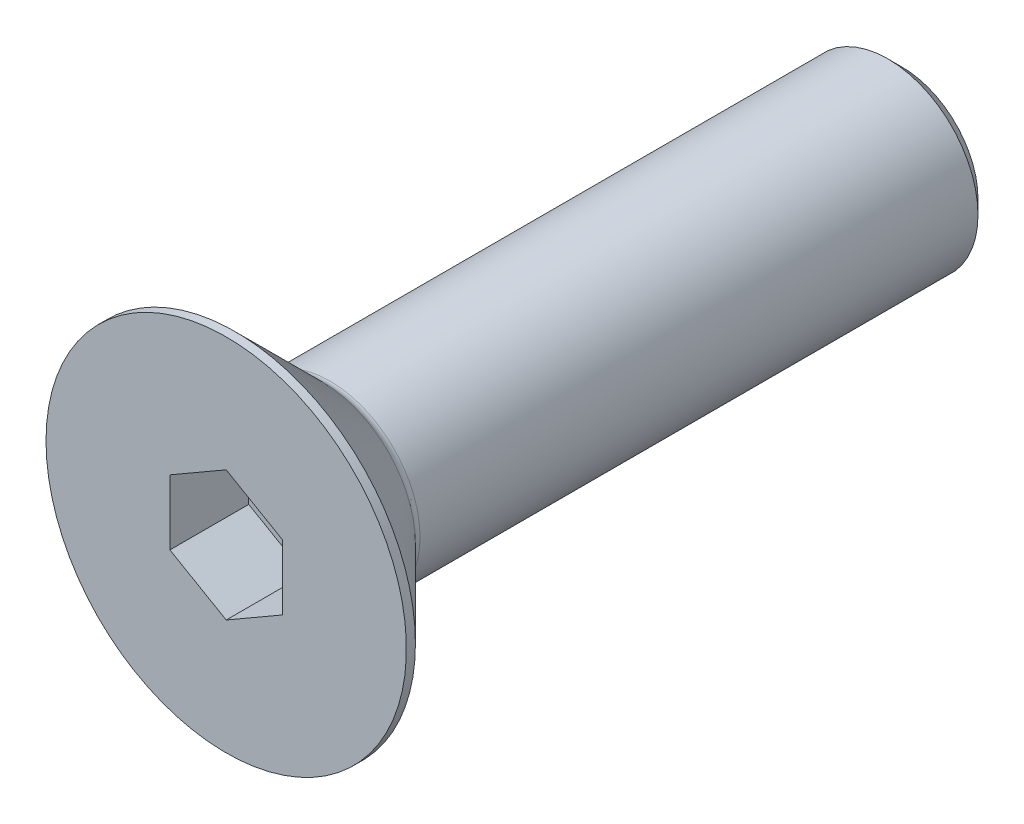
ISO-10303-21;
HEADER;
FILE_DESCRIPTION(('STEP AP214'),'2;1');
FILE_NAME('part.step','',(''),(''),'','','');
FILE_SCHEMA(('AUTOMOTIVE_DESIGN { 1 0 10303 214 1 1 1 1 }'));
ENDSEC;
DATA;
#1=APPLICATION_CONTEXT('core data for automotive mechanical design processes');
#2=APPLICATION_PROTOCOL_DEFINITION('international standard','automotive_design',2000,#1);
#3=PRODUCT_CONTEXT('',#1,'mechanical');
#4=PRODUCT('Part','Part','',(#3));
#5=PRODUCT_RELATED_PRODUCT_CATEGORY('part','',(#4));
#6=PRODUCT_DEFINITION_FORMATION('','',#4);
#7=PRODUCT_DEFINITION_CONTEXT('part definition',#1,'design');
#8=PRODUCT_DEFINITION('design','',#6,#7);
#9=PRODUCT_DEFINITION_SHAPE('','',#8);
#10=(LENGTH_UNIT() NAMED_UNIT(*) SI_UNIT(.MILLI.,.METRE.));
#11=(NAMED_UNIT(*) PLANE_ANGLE_UNIT() SI_UNIT($,.RADIAN.));
#12=(NAMED_UNIT(*) SI_UNIT($,.STERADIAN.) SOLID_ANGLE_UNIT());
#13=UNCERTAINTY_MEASURE_WITH_UNIT(LENGTH_MEASURE(1.E-05),#10,'distance_accuracy_value','');
#14=(GEOMETRIC_REPRESENTATION_CONTEXT(3) GLOBAL_UNCERTAINTY_ASSIGNED_CONTEXT((#13)) GLOBAL_UNIT_ASSIGNED_CONTEXT((#10,
#11,#12)) REPRESENTATION_CONTEXT('',''));
#15=CARTESIAN_POINT('',(0.,0.,0.));
#16=DIRECTION('',(0.,0.,1.));
#17=DIRECTION('',(1.,0.,0.));
#18=AXIS2_PLACEMENT_3D('',#15,#16,#17);
#19=CARTESIAN_POINT('',(0.,0.,-3.5));
#20=DIRECTION('',(0.,0.,1.));
#21=DIRECTION('',(1.,0.,0.));
#22=AXIS2_PLACEMENT_3D('',#19,#20,#21);
#23=PLANE('',#22);
#24=DIRECTION('',(-0.866025403784439,-0.5,0.));
#25=VECTOR('',#24,1.);
#26=CARTESIAN_POINT('',(0.,2.88675134594813,-3.5));
#27=LINE('',#26,#25);
#28=CARTESIAN_POINT('',(0.,2.88675134594813,-3.5));
#29=VERTEX_POINT('',#28);
#30=CARTESIAN_POINT('',(-2.5,1.44337567297406,-3.5));
#31=VERTEX_POINT('',#30);
#32=EDGE_CURVE('E82',#29,#31,#27,.T.);
#33=ORIENTED_EDGE('',*,*,#32,.T.);
#34=DIRECTION('',(0.,1.,0.));
#35=VECTOR('',#34,1.);
#36=CARTESIAN_POINT('',(-2.5,1.44337567297406,-3.5));
#37=LINE('',#36,#35);
#38=CARTESIAN_POINT('',(-2.5,-1.44337567297407,-3.5));
#39=VERTEX_POINT('',#38);
#40=EDGE_CURVE('E66',#31,#39,#37,.F.);
#41=ORIENTED_EDGE('',*,*,#40,.T.);
#42=DIRECTION('',(0.866025403784439,-0.499999999999999,0.));
#43=VECTOR('',#42,1.);
#44=CARTESIAN_POINT('',(-2.5,-1.44337567297407,-3.5));
#45=LINE('',#44,#43);
#46=CARTESIAN_POINT('',(0.,-2.88675134594813,-3.5));
#47=VERTEX_POINT('',#46);
#48=EDGE_CURVE('E71',#39,#47,#45,.T.);
#49=ORIENTED_EDGE('',*,*,#48,.T.);
#50=DIRECTION('',(0.866025403784439,0.5,0.));
#51=VECTOR('',#50,1.);
#52=CARTESIAN_POINT('',(0.,-2.88675134594813,-3.5));
#53=LINE('',#52,#51);
#54=CARTESIAN_POINT('',(2.5,-1.44337567297406,-3.5));
#55=VERTEX_POINT('',#54);
#56=EDGE_CURVE('E128',#47,#55,#53,.T.);
#57=ORIENTED_EDGE('',*,*,#56,.T.);
#58=DIRECTION('',(0.,1.,0.));
#59=VECTOR('',#58,1.);
#60=CARTESIAN_POINT('',(2.5,-1.44337567297406,-3.5));
#61=LINE('',#60,#59);
#62=CARTESIAN_POINT('',(2.5,1.44337567297407,-3.5));
#63=VERTEX_POINT('',#62);
#64=EDGE_CURVE('E132',#55,#63,#61,.T.);
#65=ORIENTED_EDGE('',*,*,#64,.T.);
#66=DIRECTION('',(-0.866025403784439,0.499999999999999,0.));
#67=VECTOR('',#66,1.);
#68=CARTESIAN_POINT('',(2.5,1.44337567297407,-3.5));
#69=LINE('',#68,#67);
#70=EDGE_CURVE('E137',#63,#29,#69,.T.);
#71=ORIENTED_EDGE('',*,*,#70,.T.);
#72=EDGE_LOOP('',(#33,#41,#49,#57,#65,#71));
#73=FACE_BOUND('',#72,.T.);
#74=ADVANCED_FACE('F15',(#73),#23,.T.);
#75=CARTESIAN_POINT('',(-2.5,-1.44337567297407,0.));
#76=DIRECTION('',(-0.499999999999999,-0.866025403784439,0.));
#77=DIRECTION('',(0.866025403784439,-0.499999999999999,0.));
#78=AXIS2_PLACEMENT_3D('',#75,#76,#77);
#79=PLANE('',#78);
#80=DIRECTION('',(0.,0.,1.));
#81=VECTOR('',#80,1.);
#82=CARTESIAN_POINT('',(-2.5,-1.44337567297407,0.));
#83=LINE('',#82,#81);
#84=CARTESIAN_POINT('',(-2.5,-1.44337567297407,0.));
#85=VERTEX_POINT('',#84);
#86=EDGE_CURVE('E73',#39,#85,#83,.T.);
#87=ORIENTED_EDGE('',*,*,#86,.T.);
#88=DIRECTION('',(-0.866025403784439,0.499999999999999,0.));
#89=VECTOR('',#88,1.);
#90=CARTESIAN_POINT('',(0.,-2.88675134594813,0.));
#91=LINE('',#90,#89);
#92=CARTESIAN_POINT('',(0.,-2.88675134594813,0.));
#93=VERTEX_POINT('',#92);
#94=EDGE_CURVE('E126',#93,#85,#91,.T.);
#95=ORIENTED_EDGE('',*,*,#94,.F.);
#96=DIRECTION('',(0.,0.,1.));
#97=VECTOR('',#96,1.);
#98=CARTESIAN_POINT('',(0.,-2.88675134594813,0.));
#99=LINE('',#98,#97);
#100=EDGE_CURVE('E76',#93,#47,#99,.F.);
#101=ORIENTED_EDGE('',*,*,#100,.T.);
#102=ORIENTED_EDGE('',*,*,#48,.F.);
#103=EDGE_LOOP('',(#87,#95,#101,#102));
#104=FACE_BOUND('',#103,.T.);
#105=ADVANCED_FACE('F72',(#104),#79,.F.);
#106=CARTESIAN_POINT('',(-2.5,1.44337567297406,0.));
#107=DIRECTION('',(-1.,0.,0.));
#108=DIRECTION('',(0.,0.,1.));
#109=AXIS2_PLACEMENT_3D('',#106,#107,#108);
#110=PLANE('',#109);
#111=DIRECTION('',(0.,0.,1.));
#112=VECTOR('',#111,1.);
#113=CARTESIAN_POINT('',(-2.5,1.44337567297406,0.));
#114=LINE('',#113,#112);
#115=CARTESIAN_POINT('',(-2.5,1.44337567297406,0.));
#116=VERTEX_POINT('',#115);
#117=EDGE_CURVE('E84',#31,#116,#114,.T.);
#118=ORIENTED_EDGE('',*,*,#117,.T.);
#119=DIRECTION('',(0.,1.,0.));
#120=VECTOR('',#119,1.);
#121=CARTESIAN_POINT('',(-2.5,0.,0.));
#122=LINE('',#121,#120);
#123=EDGE_CURVE('E88',#85,#116,#122,.T.);
#124=ORIENTED_EDGE('',*,*,#123,.F.);
#125=ORIENTED_EDGE('',*,*,#86,.F.);
#126=ORIENTED_EDGE('',*,*,#40,.F.);
#127=EDGE_LOOP('',(#118,#124,#125,#126));
#128=FACE_BOUND('',#127,.T.);
#129=ADVANCED_FACE('F86',(#128),#110,.F.);
#130=CARTESIAN_POINT('',(0.,2.88675134594813,0.));
#131=DIRECTION('',(-0.5,0.866025403784439,0.));
#132=DIRECTION('',(-0.866025403784439,-0.5,0.));
#133=AXIS2_PLACEMENT_3D('',#130,#131,#132);
#134=PLANE('',#133);
#135=DIRECTION('',(0.,0.,1.));
#136=VECTOR('',#135,1.);
#137=CARTESIAN_POINT('',(0.,2.88675134594813,0.));
#138=LINE('',#137,#136);
#139=CARTESIAN_POINT('',(0.,2.88675134594813,0.));
#140=VERTEX_POINT('',#139);
#141=EDGE_CURVE('E139',#29,#140,#138,.T.);
#142=ORIENTED_EDGE('',*,*,#141,.T.);
#143=DIRECTION('',(0.866025403784439,0.499999999999999,0.));
#144=VECTOR('',#143,1.);
#145=CARTESIAN_POINT('',(-2.5,1.44337567297406,0.));
#146=LINE('',#145,#144);
#147=EDGE_CURVE('E122',#116,#140,#146,.T.);
#148=ORIENTED_EDGE('',*,*,#147,.F.);
#149=ORIENTED_EDGE('',*,*,#117,.F.);
#150=ORIENTED_EDGE('',*,*,#32,.F.);
#151=EDGE_LOOP('',(#142,#148,#149,#150));
#152=FACE_BOUND('',#151,.T.);
#153=ADVANCED_FACE('F143',(#152),#134,.F.);
#154=CARTESIAN_POINT('',(2.5,1.44337567297407,0.));
#155=DIRECTION('',(0.499999999999999,0.866025403784439,0.));
#156=DIRECTION('',(-0.866025403784439,0.499999999999999,0.));
#157=AXIS2_PLACEMENT_3D('',#154,#155,#156);
#158=PLANE('',#157);
#159=DIRECTION('',(0.,0.,-1.));
#160=VECTOR('',#159,1.);
#161=CARTESIAN_POINT('',(2.5,1.44337567297407,0.));
#162=LINE('',#161,#160);
#163=CARTESIAN_POINT('',(2.5,1.44337567297407,0.));
#164=VERTEX_POINT('',#163);
#165=EDGE_CURVE('E135',#63,#164,#162,.F.);
#166=ORIENTED_EDGE('',*,*,#165,.T.);
#167=DIRECTION('',(0.866025403784439,-0.499999999999999,0.));
#168=VECTOR('',#167,1.);
#169=CARTESIAN_POINT('',(0.,2.88675134594813,0.));
#170=LINE('',#169,#168);
#171=EDGE_CURVE('E119',#140,#164,#170,.T.);
#172=ORIENTED_EDGE('',*,*,#171,.F.);
#173=ORIENTED_EDGE('',*,*,#141,.F.);
#174=ORIENTED_EDGE('',*,*,#70,.F.);
#175=EDGE_LOOP('',(#166,#172,#173,#174));
#176=FACE_BOUND('',#175,.T.);
#177=ADVANCED_FACE('F154',(#176),#158,.F.);
#178=CARTESIAN_POINT('',(2.5,-1.44337567297406,0.));
#179=DIRECTION('',(1.,0.,0.));
#180=DIRECTION('',(0.,0.,-1.));
#181=AXIS2_PLACEMENT_3D('',#178,#179,#180);
#182=PLANE('',#181);
#183=DIRECTION('',(0.,0.,1.));
#184=VECTOR('',#183,1.);
#185=CARTESIAN_POINT('',(2.5,-1.44337567297406,0.));
#186=LINE('',#185,#184);
#187=CARTESIAN_POINT('',(2.5,-1.44337567297406,0.));
#188=VERTEX_POINT('',#187);
#189=EDGE_CURVE('E34',#55,#188,#186,.T.);
#190=ORIENTED_EDGE('',*,*,#189,.T.);
#191=DIRECTION('',(0.,1.,0.));
#192=VECTOR('',#191,1.);
#193=CARTESIAN_POINT('',(2.5,0.,0.));
#194=LINE('',#193,#192);
#195=EDGE_CURVE('E116',#164,#188,#194,.F.);
#196=ORIENTED_EDGE('',*,*,#195,.F.);
#197=ORIENTED_EDGE('',*,*,#165,.F.);
#198=ORIENTED_EDGE('',*,*,#64,.F.);
#199=EDGE_LOOP('',(#190,#196,#197,#198));
#200=FACE_BOUND('',#199,.T.);
#201=ADVANCED_FACE('F152',(#200),#182,.F.);
#202=CARTESIAN_POINT('',(0.,-2.88675134594813,0.));
#203=DIRECTION('',(0.5,-0.866025403784439,0.));
#204=DIRECTION('',(0.866025403784439,0.5,0.));
#205=AXIS2_PLACEMENT_3D('',#202,#203,#204);
#206=PLANE('',#205);
#207=ORIENTED_EDGE('',*,*,#100,.F.);
#208=DIRECTION('',(-0.866025403784439,-0.499999999999999,0.));
#209=VECTOR('',#208,1.);
#210=CARTESIAN_POINT('',(2.5,-1.44337567297406,0.));
#211=LINE('',#210,#209);
#212=EDGE_CURVE('E113',#188,#93,#211,.T.);
#213=ORIENTED_EDGE('',*,*,#212,.F.);
#214=ORIENTED_EDGE('',*,*,#189,.F.);
#215=ORIENTED_EDGE('',*,*,#56,.F.);
#216=EDGE_LOOP('',(#207,#213,#214,#215));
#217=FACE_BOUND('',#216,.T.);
#218=ADVANCED_FACE('F150',(#217),#206,.F.);
#219=CARTESIAN_POINT('',(4.,0.,0.));
#220=DIRECTION('',(0.,0.,1.));
#221=DIRECTION('',(1.,0.,0.));
#222=AXIS2_PLACEMENT_3D('',#219,#220,#221);
#223=PLANE('',#222);
#224=ORIENTED_EDGE('',*,*,#195,.T.);
#225=ORIENTED_EDGE('',*,*,#212,.T.);
#226=ORIENTED_EDGE('',*,*,#94,.T.);
#227=ORIENTED_EDGE('',*,*,#123,.T.);
#228=ORIENTED_EDGE('',*,*,#147,.T.);
#229=ORIENTED_EDGE('',*,*,#171,.T.);
#230=EDGE_LOOP('',(#224,#225,#226,#227,#228,#229));
#231=FACE_BOUND('',#230,.T.);
#232=CARTESIAN_POINT('',(0.,0.,0.));
#233=DIRECTION('',(0.,0.,-1.));
#234=DIRECTION('',(-1.,0.,0.));
#235=AXIS2_PLACEMENT_3D('',#232,#233,#234);
#236=CIRCLE('',#235,8.);
#237=CARTESIAN_POINT('',(-8.,0.,0.));
#238=VERTEX_POINT('',#237);
#239=EDGE_CURVE('E19',#238,#238,#236,.T.);
#240=ORIENTED_EDGE('',*,*,#239,.F.);
#241=EDGE_LOOP('',(#240));
#242=FACE_BOUND('',#241,.T.);
#243=ADVANCED_FACE('F147',(#231,#242),#223,.T.);
#244=CARTESIAN_POINT('',(0.,0.,-0.2));
#245=DIRECTION('',(0.,0.,-1.));
#246=DIRECTION('',(-1.,0.,0.));
#247=AXIS2_PLACEMENT_3D('',#244,#245,#246);
#248=CYLINDRICAL_SURFACE('',#247,8.);
#249=ORIENTED_EDGE('',*,*,#239,.T.);
#250=EDGE_LOOP('',(#249));
#251=FACE_BOUND('',#250,.T.);
#252=CARTESIAN_POINT('',(0.,0.,-0.399999998251133));
#253=DIRECTION('',(0.,0.,1.));
#254=DIRECTION('',(1.,0.,0.));
#255=AXIS2_PLACEMENT_3D('',#252,#253,#254);
#256=CIRCLE('',#255,7.99999999821921);
#257=CARTESIAN_POINT('',(7.99999999821921,0.,-0.399999998251133));
#258=VERTEX_POINT('',#257);
#259=EDGE_CURVE('E100',#258,#258,#256,.F.);
#260=ORIENTED_EDGE('',*,*,#259,.F.);
#261=EDGE_LOOP('',(#260));
#262=FACE_BOUND('',#261,.T.);
#263=ADVANCED_FACE('F183',(#251,#262),#248,.T.);
#264=CARTESIAN_POINT('',(0.,0.,-0.399999998251133));
#265=DIRECTION('',(0.,0.,1.));
#266=DIRECTION('',(1.,0.,0.));
#267=AXIS2_PLACEMENT_3D('',#264,#265,#266);
#268=CONICAL_SURFACE('',#267,7.99999999821921,0.785398162505018);
#269=CARTESIAN_POINT('',(0.,0.,-4.25355339059328));
#270=DIRECTION('',(0.,0.,-1.));
#271=DIRECTION('',(0.,1.,0.));
#272=AXIS2_PLACEMENT_3D('',#269,#270,#271);
#273=CIRCLE('',#272,4.14644660940673);
#274=CARTESIAN_POINT('',(0.,4.14644660940673,-4.25355339059328));
#275=VERTEX_POINT('',#274);
#276=EDGE_CURVE('E94',#275,#275,#273,.T.);
#277=ORIENTED_EDGE('',*,*,#276,.F.);
#278=EDGE_LOOP('',(#277));
#279=FACE_BOUND('',#278,.T.);
#280=ORIENTED_EDGE('',*,*,#259,.T.);
#281=EDGE_LOOP('',(#280));
#282=FACE_BOUND('',#281,.T.);
#283=ADVANCED_FACE('F179',(#279,#282),#268,.T.);
#284=CARTESIAN_POINT('',(2.,0.,-30.));
#285=DIRECTION('',(0.,0.,-1.));
#286=DIRECTION('',(-1.,0.,0.));
#287=AXIS2_PLACEMENT_3D('',#284,#285,#286);
#288=PLANE('',#287);
#289=CARTESIAN_POINT('',(0.,0.,-30.0000000003138));
#290=DIRECTION('',(0.,0.,1.));
#291=DIRECTION('',(1.,0.,0.));
#292=AXIS2_PLACEMENT_3D('',#289,#290,#291);
#293=CIRCLE('',#292,3.37500000034652);
#294=CARTESIAN_POINT('',(3.37500000034652,0.,-30.0000000003138));
#295=VERTEX_POINT('',#294);
#296=EDGE_CURVE('E92',#295,#295,#293,.T.);
#297=ORIENTED_EDGE('',*,*,#296,.F.);
#298=EDGE_LOOP('',(#297));
#299=FACE_BOUND('',#298,.T.);
#300=ADVANCED_FACE('F176',(#299),#288,.T.);
#301=CARTESIAN_POINT('',(0.,0.,-4.60710678118655));
#302=DIRECTION('',(0.,0.,-1.));
#303=DIRECTION('',(-1.,0.,0.));
#304=AXIS2_PLACEMENT_3D('',#301,#302,#303);
#305=TOROIDAL_SURFACE('',#304,4.5,0.5);
#306=CARTESIAN_POINT('',(0.,0.,-4.60710678118655));
#307=DIRECTION('',(0.,0.,-1.));
#308=DIRECTION('',(-1.,0.,0.));
#309=AXIS2_PLACEMENT_3D('',#306,#307,#308);
#310=CIRCLE('',#309,4.);
#311=CARTESIAN_POINT('',(-4.,0.,-4.60710678118655));
#312=VERTEX_POINT('',#311);
#313=EDGE_CURVE('E25',#312,#312,#310,.T.);
#314=ORIENTED_EDGE('',*,*,#313,.F.);
#315=EDGE_LOOP('',(#314));
#316=FACE_BOUND('',#315,.T.);
#317=ORIENTED_EDGE('',*,*,#276,.T.);
#318=EDGE_LOOP('',(#317));
#319=FACE_BOUND('',#318,.T.);
#320=ADVANCED_FACE('F17',(#316,#319),#305,.F.);
#321=CARTESIAN_POINT('',(0.,0.,-29.3749999998454));
#322=DIRECTION('',(0.,0.,1.));
#323=DIRECTION('',(1.,0.,0.));
#324=AXIS2_PLACEMENT_3D('',#321,#322,#323);
#325=CONICAL_SURFACE('',#324,3.99999999967804,0.785398162487954);
#326=ORIENTED_EDGE('',*,*,#296,.T.);
#327=EDGE_LOOP('',(#326));
#328=FACE_BOUND('',#327,.T.);
#329=CARTESIAN_POINT('',(0.,0.,-29.375));
#330=DIRECTION('',(0.,0.,-1.));
#331=DIRECTION('',(-1.,0.,0.));
#332=AXIS2_PLACEMENT_3D('',#329,#330,#331);
#333=CIRCLE('',#332,4.);
#334=CARTESIAN_POINT('',(-4.,0.,-29.375));
#335=VERTEX_POINT('',#334);
#336=EDGE_CURVE('E10',#335,#335,#333,.F.);
#337=ORIENTED_EDGE('',*,*,#336,.F.);
#338=EDGE_LOOP('',(#337));
#339=FACE_BOUND('',#338,.T.);
#340=ADVANCED_FACE('F166',(#328,#339),#325,.T.);
#341=CARTESIAN_POINT('',(0.,0.,-17.2));
#342=DIRECTION('',(0.,0.,-1.));
#343=DIRECTION('',(-1.,0.,0.));
#344=AXIS2_PLACEMENT_3D('',#341,#342,#343);
#345=CYLINDRICAL_SURFACE('',#344,4.);
#346=ORIENTED_EDGE('',*,*,#336,.T.);
#347=EDGE_LOOP('',(#346));
#348=FACE_BOUND('',#347,.T.);
#349=ORIENTED_EDGE('',*,*,#313,.T.);
#350=EDGE_LOOP('',(#349));
#351=FACE_BOUND('',#350,.T.);
#352=ADVANCED_FACE('F164',(#348,#351),#345,.T.);
#353=CLOSED_SHELL('',(#74,#105,#129,#153,#177,#201,#218,#243,#263,#283,#300,#320,#340,#352));
#354=MANIFOLD_SOLID_BREP('B1',#353);
#355=ADVANCED_BREP_SHAPE_REPRESENTATION('',(#18,#354),#14);
#356=SHAPE_DEFINITION_REPRESENTATION(#9,#355);
ENDSEC;
END-ISO-10303-21;
